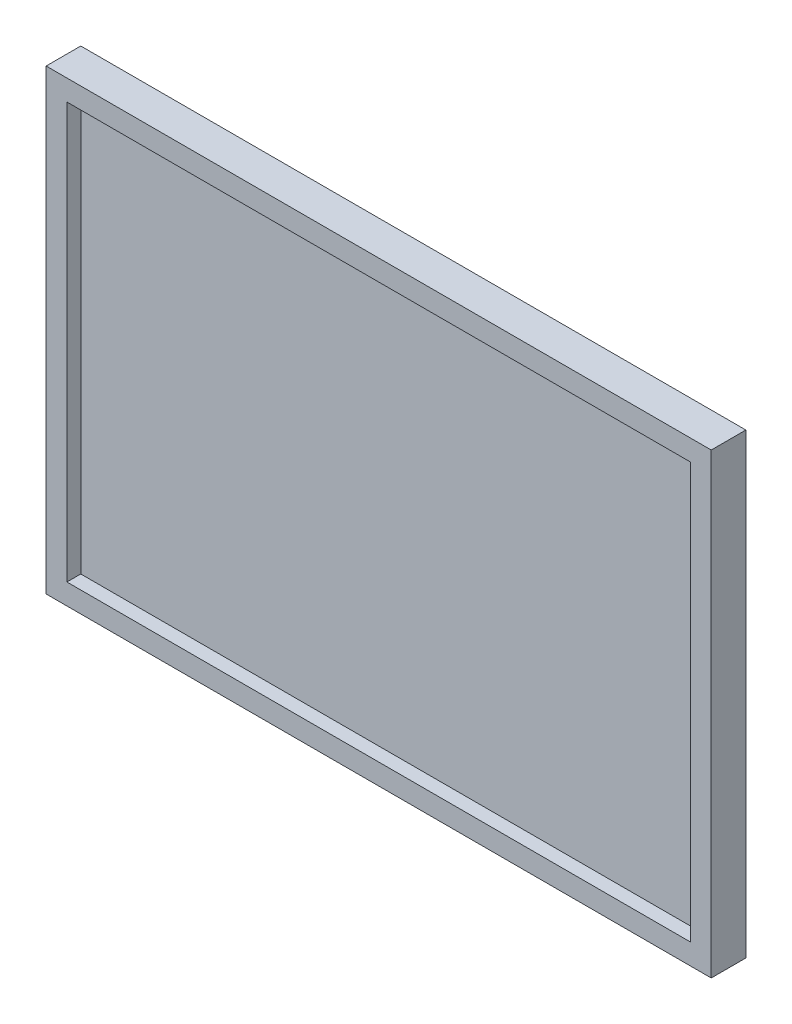
ISO-10303-21;
HEADER;
FILE_DESCRIPTION(('STEP AP214'),'2;1');
FILE_NAME('part.step','',(''),(''),'','','');
FILE_SCHEMA(('AUTOMOTIVE_DESIGN { 1 0 10303 214 1 1 1 1 }'));
ENDSEC;
DATA;
#1=APPLICATION_CONTEXT('core data for automotive mechanical design processes');
#2=APPLICATION_PROTOCOL_DEFINITION('international standard','automotive_design',2000,#1);
#3=PRODUCT_CONTEXT('',#1,'mechanical');
#4=PRODUCT('Part','Part','',(#3));
#5=PRODUCT_RELATED_PRODUCT_CATEGORY('part','',(#4));
#6=PRODUCT_DEFINITION_FORMATION('','',#4);
#7=PRODUCT_DEFINITION_CONTEXT('part definition',#1,'design');
#8=PRODUCT_DEFINITION('design','',#6,#7);
#9=PRODUCT_DEFINITION_SHAPE('','',#8);
#10=(LENGTH_UNIT() NAMED_UNIT(*) SI_UNIT(.MILLI.,.METRE.));
#11=(NAMED_UNIT(*) PLANE_ANGLE_UNIT() SI_UNIT($,.RADIAN.));
#12=(NAMED_UNIT(*) SI_UNIT($,.STERADIAN.) SOLID_ANGLE_UNIT());
#13=UNCERTAINTY_MEASURE_WITH_UNIT(LENGTH_MEASURE(1.E-05),#10,'distance_accuracy_value','');
#14=(GEOMETRIC_REPRESENTATION_CONTEXT(3) GLOBAL_UNCERTAINTY_ASSIGNED_CONTEXT((#13)) GLOBAL_UNIT_ASSIGNED_CONTEXT((#10,
#11,#12)) REPRESENTATION_CONTEXT('',''));
#15=CARTESIAN_POINT('',(0.,0.,0.));
#16=DIRECTION('',(0.,0.,1.));
#17=DIRECTION('',(1.,0.,0.));
#18=AXIS2_PLACEMENT_3D('',#15,#16,#17);
#19=CARTESIAN_POINT('',(-186.,126.,10.));
#20=DIRECTION('',(1.,0.,0.));
#21=DIRECTION('',(0.,1.,0.));
#22=AXIS2_PLACEMENT_3D('',#19,#20,#21);
#23=PLANE('',#22);
#24=DIRECTION('',(0.,-1.,0.));
#25=VECTOR('',#24,1.);
#26=CARTESIAN_POINT('',(-186.,126.,0.));
#27=LINE('',#26,#25);
#28=CARTESIAN_POINT('',(-186.,126.,0.));
#29=VERTEX_POINT('',#28);
#30=CARTESIAN_POINT('',(-186.,-6.,0.));
#31=VERTEX_POINT('',#30);
#32=EDGE_CURVE('E157',#29,#31,#27,.T.);
#33=ORIENTED_EDGE('',*,*,#32,.T.);
#34=DIRECTION('',(0.,0.,-1.));
#35=VECTOR('',#34,1.);
#36=CARTESIAN_POINT('',(-186.,-6.,10.));
#37=LINE('',#36,#35);
#38=CARTESIAN_POINT('',(-186.,-6.,10.));
#39=VERTEX_POINT('',#38);
#40=EDGE_CURVE('E11',#39,#31,#37,.T.);
#41=ORIENTED_EDGE('',*,*,#40,.F.);
#42=DIRECTION('',(0.,-1.,0.));
#43=VECTOR('',#42,1.);
#44=CARTESIAN_POINT('',(-186.,126.,10.));
#45=LINE('',#44,#43);
#46=CARTESIAN_POINT('',(-186.,126.,10.));
#47=VERTEX_POINT('',#46);
#48=EDGE_CURVE('E163',#47,#39,#45,.T.);
#49=ORIENTED_EDGE('',*,*,#48,.F.);
#50=DIRECTION('',(0.,0.,-1.));
#51=VECTOR('',#50,1.);
#52=CARTESIAN_POINT('',(-186.,126.,10.));
#53=LINE('',#52,#51);
#54=EDGE_CURVE('E63',#47,#29,#53,.T.);
#55=ORIENTED_EDGE('',*,*,#54,.T.);
#56=EDGE_LOOP('',(#33,#41,#49,#55));
#57=FACE_BOUND('',#56,.T.);
#58=ADVANCED_FACE('F39',(#57),#23,.F.);
#59=CARTESIAN_POINT('',(-186.,-6.,10.));
#60=DIRECTION('',(0.,1.,0.));
#61=DIRECTION('',(0.,0.,1.));
#62=AXIS2_PLACEMENT_3D('',#59,#60,#61);
#63=PLANE('',#62);
#64=DIRECTION('',(1.,0.,0.));
#65=VECTOR('',#64,1.);
#66=CARTESIAN_POINT('',(-186.,-6.,0.));
#67=LINE('',#66,#65);
#68=CARTESIAN_POINT('',(6.00000000000003,-6.,0.));
#69=VERTEX_POINT('',#68);
#70=EDGE_CURVE('E178',#31,#69,#67,.T.);
#71=ORIENTED_EDGE('',*,*,#70,.T.);
#72=DIRECTION('',(0.,0.,-1.));
#73=VECTOR('',#72,1.);
#74=CARTESIAN_POINT('',(6.00000000000003,-6.,10.));
#75=LINE('',#74,#73);
#76=CARTESIAN_POINT('',(6.00000000000003,-6.,10.));
#77=VERTEX_POINT('',#76);
#78=EDGE_CURVE('E47',#77,#69,#75,.T.);
#79=ORIENTED_EDGE('',*,*,#78,.F.);
#80=DIRECTION('',(1.,0.,0.));
#81=VECTOR('',#80,1.);
#82=CARTESIAN_POINT('',(-186.,-6.,10.));
#83=LINE('',#82,#81);
#84=EDGE_CURVE('E89',#39,#77,#83,.T.);
#85=ORIENTED_EDGE('',*,*,#84,.F.);
#86=ORIENTED_EDGE('',*,*,#40,.T.);
#87=EDGE_LOOP('',(#71,#79,#85,#86));
#88=FACE_BOUND('',#87,.T.);
#89=ADVANCED_FACE('F198',(#88),#63,.F.);
#90=CARTESIAN_POINT('',(6.,126.,10.));
#91=DIRECTION('',(1.,0.,0.));
#92=DIRECTION('',(0.,1.,0.));
#93=AXIS2_PLACEMENT_3D('',#90,#91,#92);
#94=PLANE('',#93);
#95=DIRECTION('',(0.,-1.,0.));
#96=VECTOR('',#95,1.);
#97=CARTESIAN_POINT('',(6.,126.,0.));
#98=LINE('',#97,#96);
#99=CARTESIAN_POINT('',(6.,126.,0.));
#100=VERTEX_POINT('',#99);
#101=EDGE_CURVE('E182',#100,#69,#98,.T.);
#102=ORIENTED_EDGE('',*,*,#101,.F.);
#103=DIRECTION('',(0.,0.,-1.));
#104=VECTOR('',#103,1.);
#105=CARTESIAN_POINT('',(6.,126.,10.));
#106=LINE('',#105,#104);
#107=CARTESIAN_POINT('',(6.,126.,10.));
#108=VERTEX_POINT('',#107);
#109=EDGE_CURVE('E191',#108,#100,#106,.T.);
#110=ORIENTED_EDGE('',*,*,#109,.F.);
#111=DIRECTION('',(0.,-1.,0.));
#112=VECTOR('',#111,1.);
#113=CARTESIAN_POINT('',(6.,126.,10.));
#114=LINE('',#113,#112);
#115=EDGE_CURVE('E169',#108,#77,#114,.T.);
#116=ORIENTED_EDGE('',*,*,#115,.T.);
#117=ORIENTED_EDGE('',*,*,#78,.T.);
#118=EDGE_LOOP('',(#102,#110,#116,#117));
#119=FACE_BOUND('',#118,.T.);
#120=ADVANCED_FACE('F196',(#119),#94,.T.);
#121=CARTESIAN_POINT('',(-186.,126.,10.));
#122=DIRECTION('',(0.,1.,0.));
#123=DIRECTION('',(0.,0.,1.));
#124=AXIS2_PLACEMENT_3D('',#121,#122,#123);
#125=PLANE('',#124);
#126=DIRECTION('',(1.,0.,0.));
#127=VECTOR('',#126,1.);
#128=CARTESIAN_POINT('',(-186.,126.,0.));
#129=LINE('',#128,#127);
#130=EDGE_CURVE('E166',#29,#100,#129,.T.);
#131=ORIENTED_EDGE('',*,*,#130,.F.);
#132=ORIENTED_EDGE('',*,*,#54,.F.);
#133=DIRECTION('',(1.,0.,0.));
#134=VECTOR('',#133,1.);
#135=CARTESIAN_POINT('',(-186.,126.,10.));
#136=LINE('',#135,#134);
#137=EDGE_CURVE('E173',#47,#108,#136,.T.);
#138=ORIENTED_EDGE('',*,*,#137,.T.);
#139=ORIENTED_EDGE('',*,*,#109,.T.);
#140=EDGE_LOOP('',(#131,#132,#138,#139));
#141=FACE_BOUND('',#140,.T.);
#142=ADVANCED_FACE('F202',(#141),#125,.T.);
#143=CARTESIAN_POINT('',(0.,0.,10.));
#144=DIRECTION('',(0.,0.,1.));
#145=DIRECTION('',(1.,0.,0.));
#146=AXIS2_PLACEMENT_3D('',#143,#144,#145);
#147=PLANE('',#146);
#148=DIRECTION('',(0.,-1.,0.));
#149=VECTOR('',#148,1.);
#150=CARTESIAN_POINT('',(-180.,120.,10.));
#151=LINE('',#150,#149);
#152=CARTESIAN_POINT('',(-180.,120.,10.));
#153=VERTEX_POINT('',#152);
#154=CARTESIAN_POINT('',(-180.,0.,10.));
#155=VERTEX_POINT('',#154);
#156=EDGE_CURVE('E54',#153,#155,#151,.T.);
#157=ORIENTED_EDGE('',*,*,#156,.F.);
#158=DIRECTION('',(-1.,0.,0.));
#159=VECTOR('',#158,1.);
#160=CARTESIAN_POINT('',(-180.,120.,10.));
#161=LINE('',#160,#159);
#162=CARTESIAN_POINT('',(0.,120.,10.));
#163=VERTEX_POINT('',#162);
#164=EDGE_CURVE('E135',#163,#153,#161,.T.);
#165=ORIENTED_EDGE('',*,*,#164,.F.);
#166=DIRECTION('',(0.,1.,0.));
#167=VECTOR('',#166,1.);
#168=CARTESIAN_POINT('',(0.,120.,10.));
#169=LINE('',#168,#167);
#170=CARTESIAN_POINT('',(0.,0.,10.));
#171=VERTEX_POINT('',#170);
#172=EDGE_CURVE('E139',#171,#163,#169,.T.);
#173=ORIENTED_EDGE('',*,*,#172,.F.);
#174=DIRECTION('',(1.,0.,0.));
#175=VECTOR('',#174,1.);
#176=CARTESIAN_POINT('',(-180.,0.,10.));
#177=LINE('',#176,#175);
#178=EDGE_CURVE('E148',#155,#171,#177,.T.);
#179=ORIENTED_EDGE('',*,*,#178,.F.);
#180=EDGE_LOOP('',(#157,#165,#173,#179));
#181=FACE_BOUND('',#180,.T.);
#182=ORIENTED_EDGE('',*,*,#48,.T.);
#183=ORIENTED_EDGE('',*,*,#84,.T.);
#184=ORIENTED_EDGE('',*,*,#115,.F.);
#185=ORIENTED_EDGE('',*,*,#137,.F.);
#186=EDGE_LOOP('',(#182,#183,#184,#185));
#187=FACE_BOUND('',#186,.T.);
#188=ADVANCED_FACE('F205',(#181,#187),#147,.T.);
#189=CARTESIAN_POINT('',(0.,0.,0.));
#190=DIRECTION('',(0.,0.,1.));
#191=DIRECTION('',(1.,0.,0.));
#192=AXIS2_PLACEMENT_3D('',#189,#190,#191);
#193=PLANE('',#192);
#194=ORIENTED_EDGE('',*,*,#32,.F.);
#195=ORIENTED_EDGE('',*,*,#130,.T.);
#196=ORIENTED_EDGE('',*,*,#101,.T.);
#197=ORIENTED_EDGE('',*,*,#70,.F.);
#198=EDGE_LOOP('',(#194,#195,#196,#197));
#199=FACE_BOUND('',#198,.T.);
#200=ADVANCED_FACE('F201',(#199),#193,.F.);
#201=CARTESIAN_POINT('',(-180.,120.,6.));
#202=DIRECTION('',(-1.,0.,0.));
#203=DIRECTION('',(0.,-1.,0.));
#204=AXIS2_PLACEMENT_3D('',#201,#202,#203);
#205=PLANE('',#204);
#206=ORIENTED_EDGE('',*,*,#156,.T.);
#207=DIRECTION('',(0.,0.,1.));
#208=VECTOR('',#207,1.);
#209=CARTESIAN_POINT('',(-180.,0.,6.));
#210=LINE('',#209,#208);
#211=CARTESIAN_POINT('',(-180.,0.,6.));
#212=VERTEX_POINT('',#211);
#213=EDGE_CURVE('E110',#212,#155,#210,.T.);
#214=ORIENTED_EDGE('',*,*,#213,.F.);
#215=DIRECTION('',(0.,-1.,0.));
#216=VECTOR('',#215,1.);
#217=CARTESIAN_POINT('',(-180.,120.,6.));
#218=LINE('',#217,#216);
#219=CARTESIAN_POINT('',(-180.,120.,6.));
#220=VERTEX_POINT('',#219);
#221=EDGE_CURVE('E114',#220,#212,#218,.T.);
#222=ORIENTED_EDGE('',*,*,#221,.F.);
#223=DIRECTION('',(0.,0.,1.));
#224=VECTOR('',#223,1.);
#225=CARTESIAN_POINT('',(-180.,120.,6.));
#226=LINE('',#225,#224);
#227=EDGE_CURVE('E154',#220,#153,#226,.T.);
#228=ORIENTED_EDGE('',*,*,#227,.T.);
#229=EDGE_LOOP('',(#206,#214,#222,#228));
#230=FACE_BOUND('',#229,.T.);
#231=ADVANCED_FACE('F112',(#230),#205,.F.);
#232=CARTESIAN_POINT('',(-180.,120.,6.));
#233=DIRECTION('',(0.,1.,0.));
#234=DIRECTION('',(0.,0.,1.));
#235=AXIS2_PLACEMENT_3D('',#232,#233,#234);
#236=PLANE('',#235);
#237=ORIENTED_EDGE('',*,*,#164,.T.);
#238=ORIENTED_EDGE('',*,*,#227,.F.);
#239=DIRECTION('',(-1.,0.,0.));
#240=VECTOR('',#239,1.);
#241=CARTESIAN_POINT('',(-180.,120.,6.));
#242=LINE('',#241,#240);
#243=CARTESIAN_POINT('',(0.,120.,6.));
#244=VERTEX_POINT('',#243);
#245=EDGE_CURVE('E121',#244,#220,#242,.T.);
#246=ORIENTED_EDGE('',*,*,#245,.F.);
#247=DIRECTION('',(0.,0.,1.));
#248=VECTOR('',#247,1.);
#249=CARTESIAN_POINT('',(0.,120.,6.));
#250=LINE('',#249,#248);
#251=EDGE_CURVE('E158',#244,#163,#250,.T.);
#252=ORIENTED_EDGE('',*,*,#251,.T.);
#253=EDGE_LOOP('',(#237,#238,#246,#252));
#254=FACE_BOUND('',#253,.T.);
#255=ADVANCED_FACE('F224',(#254),#236,.F.);
#256=CARTESIAN_POINT('',(0.,120.,6.));
#257=DIRECTION('',(1.,0.,0.));
#258=DIRECTION('',(0.,1.,0.));
#259=AXIS2_PLACEMENT_3D('',#256,#257,#258);
#260=PLANE('',#259);
#261=ORIENTED_EDGE('',*,*,#172,.T.);
#262=ORIENTED_EDGE('',*,*,#251,.F.);
#263=DIRECTION('',(0.,1.,0.));
#264=VECTOR('',#263,1.);
#265=CARTESIAN_POINT('',(0.,120.,6.));
#266=LINE('',#265,#264);
#267=CARTESIAN_POINT('',(0.,0.,6.));
#268=VERTEX_POINT('',#267);
#269=EDGE_CURVE('E130',#268,#244,#266,.T.);
#270=ORIENTED_EDGE('',*,*,#269,.F.);
#271=DIRECTION('',(0.,0.,1.));
#272=VECTOR('',#271,1.);
#273=CARTESIAN_POINT('',(0.,0.,6.));
#274=LINE('',#273,#272);
#275=EDGE_CURVE('E120',#268,#171,#274,.T.);
#276=ORIENTED_EDGE('',*,*,#275,.T.);
#277=EDGE_LOOP('',(#261,#262,#270,#276));
#278=FACE_BOUND('',#277,.T.);
#279=ADVANCED_FACE('F227',(#278),#260,.F.);
#280=CARTESIAN_POINT('',(-180.,0.,6.));
#281=DIRECTION('',(0.,-1.,0.));
#282=DIRECTION('',(0.,0.,-1.));
#283=AXIS2_PLACEMENT_3D('',#280,#281,#282);
#284=PLANE('',#283);
#285=ORIENTED_EDGE('',*,*,#178,.T.);
#286=ORIENTED_EDGE('',*,*,#275,.F.);
#287=DIRECTION('',(1.,0.,0.));
#288=VECTOR('',#287,1.);
#289=CARTESIAN_POINT('',(-180.,0.,6.));
#290=LINE('',#289,#288);
#291=EDGE_CURVE('E124',#212,#268,#290,.T.);
#292=ORIENTED_EDGE('',*,*,#291,.F.);
#293=ORIENTED_EDGE('',*,*,#213,.T.);
#294=EDGE_LOOP('',(#285,#286,#292,#293));
#295=FACE_BOUND('',#294,.T.);
#296=ADVANCED_FACE('F125',(#295),#284,.F.);
#297=CARTESIAN_POINT('',(0.,0.,6.));
#298=DIRECTION('',(0.,0.,1.));
#299=DIRECTION('',(1.,0.,0.));
#300=AXIS2_PLACEMENT_3D('',#297,#298,#299);
#301=PLANE('',#300);
#302=ORIENTED_EDGE('',*,*,#221,.T.);
#303=ORIENTED_EDGE('',*,*,#291,.T.);
#304=ORIENTED_EDGE('',*,*,#269,.T.);
#305=ORIENTED_EDGE('',*,*,#245,.T.);
#306=EDGE_LOOP('',(#302,#303,#304,#305));
#307=FACE_BOUND('',#306,.T.);
#308=ADVANCED_FACE('F132',(#307),#301,.T.);
#309=CLOSED_SHELL('',(#58,#89,#120,#142,#188,#200,#231,#255,#279,#296,#308));
#310=MANIFOLD_SOLID_BREP('B2',#309);
#311=ADVANCED_BREP_SHAPE_REPRESENTATION('',(#18,#310),#14);
#312=SHAPE_DEFINITION_REPRESENTATION(#9,#311);
ENDSEC;
END-ISO-10303-21;
